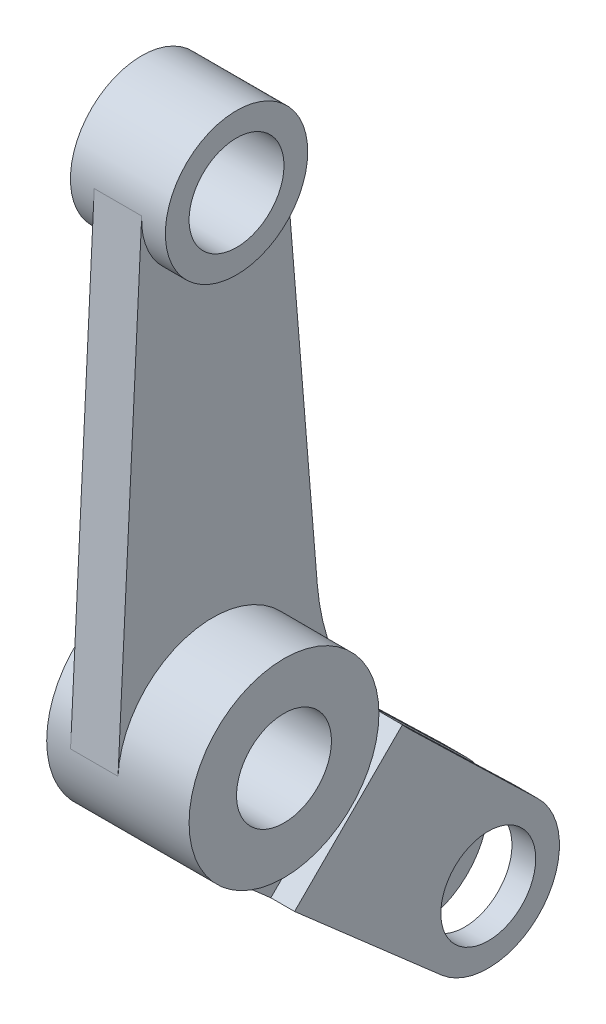
ISO-10303-21;
HEADER;
FILE_DESCRIPTION(('STEP AP214'),'2;1');
FILE_NAME('part.step','',(''),(''),'','','');
FILE_SCHEMA(('AUTOMOTIVE_DESIGN { 1 0 10303 214 1 1 1 1 }'));
ENDSEC;
DATA;
#1=APPLICATION_CONTEXT('core data for automotive mechanical design processes');
#2=APPLICATION_PROTOCOL_DEFINITION('international standard','automotive_design',2000,#1);
#3=PRODUCT_CONTEXT('',#1,'mechanical');
#4=PRODUCT('Part','Part','',(#3));
#5=PRODUCT_RELATED_PRODUCT_CATEGORY('part','',(#4));
#6=PRODUCT_DEFINITION_FORMATION('','',#4);
#7=PRODUCT_DEFINITION_CONTEXT('part definition',#1,'design');
#8=PRODUCT_DEFINITION('design','',#6,#7);
#9=PRODUCT_DEFINITION_SHAPE('','',#8);
#10=(LENGTH_UNIT() NAMED_UNIT(*) SI_UNIT(.MILLI.,.METRE.));
#11=(NAMED_UNIT(*) PLANE_ANGLE_UNIT() SI_UNIT($,.RADIAN.));
#12=(NAMED_UNIT(*) SI_UNIT($,.STERADIAN.) SOLID_ANGLE_UNIT());
#13=UNCERTAINTY_MEASURE_WITH_UNIT(LENGTH_MEASURE(1.E-05),#10,'distance_accuracy_value','');
#14=(GEOMETRIC_REPRESENTATION_CONTEXT(3) GLOBAL_UNCERTAINTY_ASSIGNED_CONTEXT((#13)) GLOBAL_UNIT_ASSIGNED_CONTEXT((#10,
#11,#12)) REPRESENTATION_CONTEXT('',''));
#15=CARTESIAN_POINT('',(0.,0.,0.));
#16=DIRECTION('',(0.,0.,1.));
#17=DIRECTION('',(1.,0.,0.));
#18=AXIS2_PLACEMENT_3D('',#15,#16,#17);
#19=CARTESIAN_POINT('',(10.,-53.0330085889911,-53.033008588991));
#20=DIRECTION('',(-1.,0.,0.));
#21=DIRECTION('',(0.,0.,1.));
#22=AXIS2_PLACEMENT_3D('',#19,#20,#21);
#23=CYLINDRICAL_SURFACE('',#22,15.);
#24=DIRECTION('',(-1.,0.,0.));
#25=VECTOR('',#24,1.);
#26=CARTESIAN_POINT('',(10.,-42.249316522445,-63.4595125770931));
#27=LINE('',#26,#25);
#28=CARTESIAN_POINT('',(0.,-42.249316522445,-63.4595125770931));
#29=VERTEX_POINT('',#28);
#30=CARTESIAN_POINT('',(-5.,-42.249316522445,-63.4595125770931));
#31=VERTEX_POINT('',#30);
#32=EDGE_CURVE('E270',#29,#31,#27,.T.);
#33=ORIENTED_EDGE('',*,*,#32,.F.);
#34=CARTESIAN_POINT('',(0.,-53.0330085889911,-53.033008588991));
#35=DIRECTION('',(-1.,0.,0.));
#36=DIRECTION('',(0.,0.,1.));
#37=AXIS2_PLACEMENT_3D('',#34,#35,#36);
#38=CIRCLE('',#37,15.);
#39=CARTESIAN_POINT('',(0.,-64.323120614436,-43.1571101259191));
#40=VERTEX_POINT('',#39);
#41=EDGE_CURVE('E49',#29,#40,#38,.T.);
#42=ORIENTED_EDGE('',*,*,#41,.T.);
#43=DIRECTION('',(-1.,0.,0.));
#44=VECTOR('',#43,1.);
#45=CARTESIAN_POINT('',(10.,-64.323120614436,-43.1571101259191));
#46=LINE('',#45,#44);
#47=CARTESIAN_POINT('',(-5.,-64.323120614436,-43.1571101259191));
#48=VERTEX_POINT('',#47);
#49=EDGE_CURVE('E175',#40,#48,#46,.T.);
#50=ORIENTED_EDGE('',*,*,#49,.T.);
#51=CARTESIAN_POINT('',(-5.,-53.0330085889911,-53.033008588991));
#52=DIRECTION('',(1.,0.,0.));
#53=DIRECTION('',(0.,0.,-1.));
#54=AXIS2_PLACEMENT_3D('',#51,#52,#53);
#55=CIRCLE('',#54,15.);
#56=EDGE_CURVE('E191',#48,#31,#55,.T.);
#57=ORIENTED_EDGE('',*,*,#56,.T.);
#58=EDGE_LOOP('',(#33,#42,#50,#57));
#59=FACE_BOUND('',#58,.T.);
#60=ADVANCED_FACE('F40',(#59),#23,.T.);
#61=CARTESIAN_POINT('',(10.,0.,0.));
#62=DIRECTION('',(1.,0.,0.));
#63=DIRECTION('',(0.,0.,-1.));
#64=AXIS2_PLACEMENT_3D('',#61,#62,#63);
#65=PLANE('',#64);
#66=DIRECTION('',(0.,-0.658393230871456,-0.75267413502966));
#67=VECTOR('',#66,1.);
#68=CARTESIAN_POINT('',(10.,-15.0534827005932,13.1678646174291));
#69=LINE('',#68,#67);
#70=CARTESIAN_POINT('',(10.,-15.0534827005932,13.1678646174291));
#71=VERTEX_POINT('',#70);
#72=CARTESIAN_POINT('',(10.,-37.2688105099598,-12.2286641730984));
#73=VERTEX_POINT('',#72);
#74=EDGE_CURVE('E267',#71,#73,#69,.T.);
#75=ORIENTED_EDGE('',*,*,#74,.T.);
#76=DIRECTION('',(0.,-0.707106781186546,0.707106781186549));
#77=VECTOR('',#76,1.);
#78=CARTESIAN_POINT('',(10.,-24.7487373415292,-24.7487373415291));
#79=LINE('',#78,#77);
#80=CARTESIAN_POINT('',(10.,-14.5505831027337,-34.9468915803247));
#81=VERTEX_POINT('',#80);
#82=EDGE_CURVE('E202',#81,#73,#79,.T.);
#83=ORIENTED_EDGE('',*,*,#82,.F.);
#84=CARTESIAN_POINT('',(10.,19.1992266841998,-71.8379520062031));
#85=DIRECTION('',(1.,0.,0.));
#86=DIRECTION('',(0.,0.,-1.));
#87=AXIS2_PLACEMENT_3D('',#84,#85,#86);
#88=CIRCLE('',#87,50.);
#89=CARTESIAN_POINT('',(10.,15.116319135825,-22.0049321704413));
#90=VERTEX_POINT('',#89);
#91=EDGE_CURVE('E258',#81,#90,#88,.F.);
#92=ORIENTED_EDGE('',*,*,#91,.T.);
#93=DIRECTION('',(0.,-0.996660396715235,-0.0816581509674995));
#94=VECTOR('',#93,1.);
#95=CARTESIAN_POINT('',(10.,1.89167762645559,-23.0884504645586));
#96=LINE('',#95,#94);
#97=CARTESIAN_POINT('',(10.,101.224872264512,-14.9499059507285));
#98=VERTEX_POINT('',#97);
#99=EDGE_CURVE('E260',#98,#90,#96,.T.);
#100=ORIENTED_EDGE('',*,*,#99,.F.);
#101=CARTESIAN_POINT('',(10.,100.,0.));
#102=DIRECTION('',(1.,0.,0.));
#103=DIRECTION('',(0.,0.,-1.));
#104=AXIS2_PLACEMENT_3D('',#101,#102,#103);
#105=CIRCLE('',#104,15.);
#106=CARTESIAN_POINT('',(10.,100.75,14.9812382665786));
#107=VERTEX_POINT('',#106);
#108=EDGE_CURVE('E251',#107,#98,#105,.T.);
#109=ORIENTED_EDGE('',*,*,#108,.F.);
#110=DIRECTION('',(0.,-0.998749217771909,0.05));
#111=VECTOR('',#110,1.);
#112=CARTESIAN_POINT('',(10.,0.999999999999999,19.9749843554382));
#113=LINE('',#112,#111);
#114=CARTESIAN_POINT('',(10.,0.999999999999999,19.9749843554382));
#115=VERTEX_POINT('',#114);
#116=EDGE_CURVE('E264',#107,#115,#113,.T.);
#117=ORIENTED_EDGE('',*,*,#116,.T.);
#118=CARTESIAN_POINT('',(10.,0.,0.));
#119=DIRECTION('',(1.,0.,0.));
#120=DIRECTION('',(0.,0.,-1.));
#121=AXIS2_PLACEMENT_3D('',#118,#119,#120);
#122=CIRCLE('',#121,20.);
#123=EDGE_CURVE('E250',#115,#71,#122,.F.);
#124=ORIENTED_EDGE('',*,*,#123,.T.);
#125=EDGE_LOOP('',(#75,#83,#92,#100,#109,#117,#124));
#126=FACE_BOUND('',#125,.T.);
#127=ADVANCED_FACE('F323',(#126),#65,.T.);
#128=CARTESIAN_POINT('',(10.,9.8758126273384,-9.54869622660444));
#129=DIRECTION('',(0.,0.718912804436409,-0.695100265873476));
#130=DIRECTION('',(0.,0.695100265873476,0.718912804436409));
#131=AXIS2_PLACEMENT_3D('',#128,#129,#130);
#132=PLANE('',#131);
#133=DIRECTION('',(0.,0.695100265873476,0.718912804436409));
#134=VECTOR('',#133,1.);
#135=CARTESIAN_POINT('',(0.,9.8758126273384,-9.54869622660444));
#136=LINE('',#135,#134);
#137=CARTESIAN_POINT('',(0.,-18.0929441372304,-38.4755983576934));
#138=VERTEX_POINT('',#137);
#139=EDGE_CURVE('E178',#29,#138,#136,.T.);
#140=ORIENTED_EDGE('',*,*,#139,.F.);
#141=ORIENTED_EDGE('',*,*,#32,.T.);
#142=DIRECTION('',(0.,0.695100265873476,0.718912804436409));
#143=VECTOR('',#142,1.);
#144=CARTESIAN_POINT('',(-5.,9.8758126273384,-9.54869622660444));
#145=LINE('',#144,#143);
#146=CARTESIAN_POINT('',(-5.,-16.7464135376208,-37.0829387125294));
#147=VERTEX_POINT('',#146);
#148=EDGE_CURVE('E188',#31,#147,#145,.T.);
#149=ORIENTED_EDGE('',*,*,#148,.T.);
#150=DIRECTION('',(-1.,0.,0.));
#151=VECTOR('',#150,1.);
#152=CARTESIAN_POINT('',(10.,-16.7464135376208,-37.0829387125294));
#153=LINE('',#152,#151);
#154=CARTESIAN_POINT('',(15.,-16.7464135376208,-37.0829387125294));
#155=VERTEX_POINT('',#154);
#156=EDGE_CURVE('E257',#155,#147,#153,.T.);
#157=ORIENTED_EDGE('',*,*,#156,.F.);
#158=DIRECTION('',(0.,0.695100265873476,0.718912804436409));
#159=VECTOR('',#158,1.);
#160=CARTESIAN_POINT('',(15.,9.8758126273384,-9.54869622660444));
#161=LINE('',#160,#159);
#162=CARTESIAN_POINT('',(15.,-42.249316522445,-63.4595125770931));
#163=VERTEX_POINT('',#162);
#164=EDGE_CURVE('E214',#163,#155,#161,.T.);
#165=ORIENTED_EDGE('',*,*,#164,.F.);
#166=CARTESIAN_POINT('',(10.,-42.249316522445,-63.4595125770931));
#167=VERTEX_POINT('',#166);
#168=EDGE_CURVE('E280',#163,#167,#27,.T.);
#169=ORIENTED_EDGE('',*,*,#168,.T.);
#170=DIRECTION('',(0.,-0.695100265873476,-0.718912804436409));
#171=VECTOR('',#170,1.);
#172=CARTESIAN_POINT('',(10.,9.8758126273384,-9.54869622660444));
#173=LINE('',#172,#171);
#174=CARTESIAN_POINT('',(10.,-18.0929441372304,-38.4755983576934));
#175=VERTEX_POINT('',#174);
#176=EDGE_CURVE('E56',#175,#167,#173,.T.);
#177=ORIENTED_EDGE('',*,*,#176,.F.);
#178=DIRECTION('',(-1.,0.,0.));
#179=VECTOR('',#178,1.);
#180=CARTESIAN_POINT('',(10.,-18.0929441372304,-38.4755983576934));
#181=LINE('',#180,#179);
#182=EDGE_CURVE('E167',#175,#138,#181,.T.);
#183=ORIENTED_EDGE('',*,*,#182,.T.);
#184=EDGE_LOOP('',(#140,#141,#149,#157,#165,#169,#177,#183));
#185=FACE_BOUND('',#184,.T.);
#186=ADVANCED_FACE('F42',(#185),#132,.T.);
#187=CARTESIAN_POINT('',(10.,19.1992266841998,-71.8379520062031));
#188=DIRECTION('',(-1.,0.,0.));
#189=DIRECTION('',(0.,0.,1.));
#190=AXIS2_PLACEMENT_3D('',#187,#188,#189);
#191=CYLINDRICAL_SURFACE('',#190,50.);
#192=ORIENTED_EDGE('',*,*,#156,.T.);
#193=CARTESIAN_POINT('',(-5.,19.1992266841998,-71.8379520062031));
#194=DIRECTION('',(1.,0.,0.));
#195=DIRECTION('',(0.,0.,-1.));
#196=AXIS2_PLACEMENT_3D('',#193,#194,#195);
#197=CIRCLE('',#196,50.);
#198=CARTESIAN_POINT('',(-5.,-14.5505831027337,-34.9468915803247));
#199=VERTEX_POINT('',#198);
#200=EDGE_CURVE('E185',#147,#199,#197,.F.);
#201=ORIENTED_EDGE('',*,*,#200,.T.);
#202=DIRECTION('',(1.,0.,0.));
#203=VECTOR('',#202,1.);
#204=CARTESIAN_POINT('',(-5.,-14.5505831027337,-34.9468915803247));
#205=LINE('',#204,#203);
#206=CARTESIAN_POINT('',(0.,-14.5505831027337,-34.9468915803247));
#207=VERTEX_POINT('',#206);
#208=EDGE_CURVE('E198',#199,#207,#205,.T.);
#209=ORIENTED_EDGE('',*,*,#208,.T.);
#210=CARTESIAN_POINT('',(0.,19.1992266841998,-71.8379520062031));
#211=DIRECTION('',(1.,0.,0.));
#212=DIRECTION('',(0.,0.,-1.));
#213=AXIS2_PLACEMENT_3D('',#210,#211,#212);
#214=CIRCLE('',#213,50.);
#215=CARTESIAN_POINT('',(0.,15.116319135825,-22.0049321704413));
#216=VERTEX_POINT('',#215);
#217=EDGE_CURVE('E254',#207,#216,#214,.F.);
#218=ORIENTED_EDGE('',*,*,#217,.T.);
#219=DIRECTION('',(-1.,0.,0.));
#220=VECTOR('',#219,1.);
#221=CARTESIAN_POINT('',(10.,15.116319135825,-22.0049321704413));
#222=LINE('',#221,#220);
#223=EDGE_CURVE('E297',#90,#216,#222,.T.);
#224=ORIENTED_EDGE('',*,*,#223,.F.);
#225=ORIENTED_EDGE('',*,*,#91,.F.);
#226=DIRECTION('',(-1.,0.,0.));
#227=VECTOR('',#226,1.);
#228=CARTESIAN_POINT('',(15.,-14.5505831027337,-34.9468915803247));
#229=LINE('',#228,#227);
#230=CARTESIAN_POINT('',(15.,-14.5505831027337,-34.9468915803247));
#231=VERTEX_POINT('',#230);
#232=EDGE_CURVE('E221',#231,#81,#229,.T.);
#233=ORIENTED_EDGE('',*,*,#232,.F.);
#234=CARTESIAN_POINT('',(15.,19.1992266841998,-71.8379520062031));
#235=DIRECTION('',(1.,0.,0.));
#236=DIRECTION('',(0.,0.,-1.));
#237=AXIS2_PLACEMENT_3D('',#234,#235,#236);
#238=CIRCLE('',#237,50.);
#239=EDGE_CURVE('E203',#155,#231,#238,.F.);
#240=ORIENTED_EDGE('',*,*,#239,.F.);
#241=EDGE_LOOP('',(#192,#201,#209,#218,#224,#225,#233,#240));
#242=FACE_BOUND('',#241,.T.);
#243=ADVANCED_FACE('F340',(#242),#191,.F.);
#244=CARTESIAN_POINT('',(10.,1.89167762645559,-23.0884504645586));
#245=DIRECTION('',(0.,0.0816581509674995,-0.996660396715235));
#246=DIRECTION('',(0.,0.996660396715235,0.0816581509674995));
#247=AXIS2_PLACEMENT_3D('',#244,#245,#246);
#248=PLANE('',#247);
#249=DIRECTION('',(0.,-0.996660396715235,-0.0816581509674995));
#250=VECTOR('',#249,1.);
#251=CARTESIAN_POINT('',(0.,1.89167762645559,-23.0884504645586));
#252=LINE('',#251,#250);
#253=CARTESIAN_POINT('',(0.,101.224872264512,-14.9499059507285));
#254=VERTEX_POINT('',#253);
#255=EDGE_CURVE('E272',#254,#216,#252,.T.);
#256=ORIENTED_EDGE('',*,*,#255,.F.);
#257=DIRECTION('',(-1.,0.,0.));
#258=VECTOR('',#257,1.);
#259=CARTESIAN_POINT('',(10.,101.224872264512,-14.9499059507285));
#260=LINE('',#259,#258);
#261=EDGE_CURVE('E294',#98,#254,#260,.T.);
#262=ORIENTED_EDGE('',*,*,#261,.F.);
#263=ORIENTED_EDGE('',*,*,#99,.T.);
#264=ORIENTED_EDGE('',*,*,#223,.T.);
#265=EDGE_LOOP('',(#256,#262,#263,#264));
#266=FACE_BOUND('',#265,.T.);
#267=ADVANCED_FACE('F380',(#266),#248,.T.);
#268=CARTESIAN_POINT('',(10.,100.,0.));
#269=DIRECTION('',(-1.,0.,0.));
#270=DIRECTION('',(0.,0.,1.));
#271=AXIS2_PLACEMENT_3D('',#268,#269,#270);
#272=CYLINDRICAL_SURFACE('',#271,15.);
#273=ORIENTED_EDGE('',*,*,#261,.T.);
#274=CARTESIAN_POINT('',(0.,100.,0.));
#275=DIRECTION('',(1.,0.,0.));
#276=DIRECTION('',(0.,0.,-1.));
#277=AXIS2_PLACEMENT_3D('',#274,#275,#276);
#278=CIRCLE('',#277,15.);
#279=CARTESIAN_POINT('',(0.,100.75,14.9812382665786));
#280=VERTEX_POINT('',#279);
#281=EDGE_CURVE('E248',#280,#254,#278,.T.);
#282=ORIENTED_EDGE('',*,*,#281,.F.);
#283=DIRECTION('',(-1.,0.,0.));
#284=VECTOR('',#283,1.);
#285=CARTESIAN_POINT('',(10.,100.75,14.9812382665786));
#286=LINE('',#285,#284);
#287=EDGE_CURVE('E291',#107,#280,#286,.T.);
#288=ORIENTED_EDGE('',*,*,#287,.F.);
#289=ORIENTED_EDGE('',*,*,#108,.T.);
#290=EDGE_LOOP('',(#273,#282,#288,#289));
#291=FACE_BOUND('',#290,.T.);
#292=CARTESIAN_POINT('',(15.,100.,0.));
#293=DIRECTION('',(1.,0.,0.));
#294=DIRECTION('',(0.,0.,-1.));
#295=AXIS2_PLACEMENT_3D('',#292,#293,#294);
#296=CIRCLE('',#295,15.);
#297=CARTESIAN_POINT('',(15.,100.,-15.));
#298=VERTEX_POINT('',#297);
#299=EDGE_CURVE('E247',#298,#298,#296,.T.);
#300=ORIENTED_EDGE('',*,*,#299,.F.);
#301=EDGE_LOOP('',(#300));
#302=FACE_BOUND('',#301,.T.);
#303=CARTESIAN_POINT('',(-5.,100.,0.));
#304=DIRECTION('',(1.,0.,0.));
#305=DIRECTION('',(0.,0.,-1.));
#306=AXIS2_PLACEMENT_3D('',#303,#304,#305);
#307=CIRCLE('',#306,15.);
#308=CARTESIAN_POINT('',(-5.,100.,-15.));
#309=VERTEX_POINT('',#308);
#310=EDGE_CURVE('E244',#309,#309,#307,.T.);
#311=ORIENTED_EDGE('',*,*,#310,.T.);
#312=EDGE_LOOP('',(#311));
#313=FACE_BOUND('',#312,.T.);
#314=ADVANCED_FACE('F376',(#291,#302,#313),#272,.T.);
#315=CARTESIAN_POINT('',(10.,0.999999999999999,19.9749843554382));
#316=DIRECTION('',(0.,-0.05,-0.998749217771909));
#317=DIRECTION('',(0.,0.998749217771909,-0.05));
#318=AXIS2_PLACEMENT_3D('',#315,#316,#317);
#319=PLANE('',#318);
#320=DIRECTION('',(0.,-0.998749217771909,0.05));
#321=VECTOR('',#320,1.);
#322=CARTESIAN_POINT('',(0.,0.999999999999999,19.9749843554382));
#323=LINE('',#322,#321);
#324=CARTESIAN_POINT('',(0.,0.999999999999999,19.9749843554382));
#325=VERTEX_POINT('',#324);
#326=EDGE_CURVE('E275',#280,#325,#323,.T.);
#327=ORIENTED_EDGE('',*,*,#326,.T.);
#328=DIRECTION('',(-1.,0.,0.));
#329=VECTOR('',#328,1.);
#330=CARTESIAN_POINT('',(10.,0.999999999999999,19.9749843554382));
#331=LINE('',#330,#329);
#332=EDGE_CURVE('E288',#115,#325,#331,.T.);
#333=ORIENTED_EDGE('',*,*,#332,.F.);
#334=ORIENTED_EDGE('',*,*,#116,.F.);
#335=ORIENTED_EDGE('',*,*,#287,.T.);
#336=EDGE_LOOP('',(#327,#333,#334,#335));
#337=FACE_BOUND('',#336,.T.);
#338=ADVANCED_FACE('F371',(#337),#319,.F.);
#339=CARTESIAN_POINT('',(10.,0.,0.));
#340=DIRECTION('',(-1.,0.,0.));
#341=DIRECTION('',(0.,0.,1.));
#342=AXIS2_PLACEMENT_3D('',#339,#340,#341);
#343=CYLINDRICAL_SURFACE('',#342,20.);
#344=ORIENTED_EDGE('',*,*,#332,.T.);
#345=CARTESIAN_POINT('',(0.,0.,0.));
#346=DIRECTION('',(-1.,0.,0.));
#347=DIRECTION('',(0.,0.,1.));
#348=AXIS2_PLACEMENT_3D('',#345,#346,#347);
#349=CIRCLE('',#348,20.);
#350=CARTESIAN_POINT('',(0.,-15.0534827005932,13.1678646174291));
#351=VERTEX_POINT('',#350);
#352=EDGE_CURVE('E235',#325,#351,#349,.T.);
#353=ORIENTED_EDGE('',*,*,#352,.T.);
#354=DIRECTION('',(-1.,0.,0.));
#355=VECTOR('',#354,1.);
#356=CARTESIAN_POINT('',(10.,-15.0534827005932,13.1678646174291));
#357=LINE('',#356,#355);
#358=EDGE_CURVE('E285',#71,#351,#357,.T.);
#359=ORIENTED_EDGE('',*,*,#358,.F.);
#360=ORIENTED_EDGE('',*,*,#123,.F.);
#361=EDGE_LOOP('',(#344,#353,#359,#360));
#362=FACE_BOUND('',#361,.T.);
#363=CARTESIAN_POINT('',(25.,0.,0.));
#364=DIRECTION('',(1.,0.,0.));
#365=DIRECTION('',(0.,0.,-1.));
#366=AXIS2_PLACEMENT_3D('',#363,#364,#365);
#367=CIRCLE('',#366,20.);
#368=CARTESIAN_POINT('',(25.,0.,-20.));
#369=VERTEX_POINT('',#368);
#370=EDGE_CURVE('E239',#369,#369,#367,.T.);
#371=ORIENTED_EDGE('',*,*,#370,.F.);
#372=EDGE_LOOP('',(#371));
#373=FACE_BOUND('',#372,.T.);
#374=CARTESIAN_POINT('',(-5.,0.,0.));
#375=DIRECTION('',(-1.,0.,0.));
#376=DIRECTION('',(0.,0.,1.));
#377=AXIS2_PLACEMENT_3D('',#374,#375,#376);
#378=CIRCLE('',#377,20.);
#379=CARTESIAN_POINT('',(-5.,0.,20.));
#380=VERTEX_POINT('',#379);
#381=EDGE_CURVE('E236',#380,#380,#378,.T.);
#382=ORIENTED_EDGE('',*,*,#381,.F.);
#383=EDGE_LOOP('',(#382));
#384=FACE_BOUND('',#383,.T.);
#385=ADVANCED_FACE('F329',(#362,#373,#384),#343,.T.);
#386=CARTESIAN_POINT('',(10.,-15.0534827005932,13.1678646174291));
#387=DIRECTION('',(0.,0.75267413502966,-0.658393230871456));
#388=DIRECTION('',(0.,0.658393230871456,0.75267413502966));
#389=AXIS2_PLACEMENT_3D('',#386,#387,#388);
#390=PLANE('',#389);
#391=ORIENTED_EDGE('',*,*,#49,.F.);
#392=DIRECTION('',(0.,0.658393230871456,0.75267413502966));
#393=VECTOR('',#392,1.);
#394=CARTESIAN_POINT('',(0.,-15.0534827005932,13.1678646174291));
#395=LINE('',#394,#393);
#396=CARTESIAN_POINT('',(0.,-40.5681166202618,-16.0004258746619));
#397=VERTEX_POINT('',#396);
#398=EDGE_CURVE('E173',#40,#397,#395,.T.);
#399=ORIENTED_EDGE('',*,*,#398,.T.);
#400=DIRECTION('',(-1.,0.,0.));
#401=VECTOR('',#400,1.);
#402=CARTESIAN_POINT('',(10.,-40.5681166202618,-16.000425874662));
#403=LINE('',#402,#401);
#404=CARTESIAN_POINT('',(10.,-40.5681166202618,-16.0004258746619));
#405=VERTEX_POINT('',#404);
#406=EDGE_CURVE('E11',#405,#397,#403,.T.);
#407=ORIENTED_EDGE('',*,*,#406,.F.);
#408=DIRECTION('',(0.,-0.658393230871456,-0.75267413502966));
#409=VECTOR('',#408,1.);
#410=CARTESIAN_POINT('',(10.,-15.0534827005932,13.1678646174291));
#411=LINE('',#410,#409);
#412=CARTESIAN_POINT('',(10.,-64.323120614436,-43.1571101259191));
#413=VERTEX_POINT('',#412);
#414=EDGE_CURVE('E153',#405,#413,#411,.T.);
#415=ORIENTED_EDGE('',*,*,#414,.T.);
#416=CARTESIAN_POINT('',(15.,-64.323120614436,-43.1571101259191));
#417=VERTEX_POINT('',#416);
#418=EDGE_CURVE('E283',#417,#413,#46,.T.);
#419=ORIENTED_EDGE('',*,*,#418,.F.);
#420=DIRECTION('',(0.,-0.658393230871456,-0.75267413502966));
#421=VECTOR('',#420,1.);
#422=CARTESIAN_POINT('',(15.,-15.0534827005932,13.1678646174291));
#423=LINE('',#422,#421);
#424=CARTESIAN_POINT('',(15.,-37.2688105099598,-12.2286641730984));
#425=VERTEX_POINT('',#424);
#426=EDGE_CURVE('E208',#425,#417,#423,.T.);
#427=ORIENTED_EDGE('',*,*,#426,.F.);
#428=DIRECTION('',(-1.,0.,0.));
#429=VECTOR('',#428,1.);
#430=CARTESIAN_POINT('',(15.,-37.2688105099598,-12.2286641730984));
#431=LINE('',#430,#429);
#432=EDGE_CURVE('E217',#425,#73,#431,.T.);
#433=ORIENTED_EDGE('',*,*,#432,.T.);
#434=ORIENTED_EDGE('',*,*,#74,.F.);
#435=ORIENTED_EDGE('',*,*,#358,.T.);
#436=DIRECTION('',(0.,-0.658393230871456,-0.75267413502966));
#437=VECTOR('',#436,1.);
#438=CARTESIAN_POINT('',(0.,-15.0534827005932,13.1678646174291));
#439=LINE('',#438,#437);
#440=CARTESIAN_POINT('',(0.,-37.2688105099598,-12.2286641730984));
#441=VERTEX_POINT('',#440);
#442=EDGE_CURVE('E261',#351,#441,#439,.T.);
#443=ORIENTED_EDGE('',*,*,#442,.T.);
#444=DIRECTION('',(1.,0.,0.));
#445=VECTOR('',#444,1.);
#446=CARTESIAN_POINT('',(-5.,-37.2688105099598,-12.2286641730984));
#447=LINE('',#446,#445);
#448=CARTESIAN_POINT('',(-5.,-37.2688105099598,-12.2286641730984));
#449=VERTEX_POINT('',#448);
#450=EDGE_CURVE('E64',#449,#441,#447,.T.);
#451=ORIENTED_EDGE('',*,*,#450,.F.);
#452=DIRECTION('',(0.,-0.658393230871456,-0.75267413502966));
#453=VECTOR('',#452,1.);
#454=CARTESIAN_POINT('',(-5.,-15.0534827005932,13.1678646174291));
#455=LINE('',#454,#453);
#456=EDGE_CURVE('E194',#449,#48,#455,.T.);
#457=ORIENTED_EDGE('',*,*,#456,.T.);
#458=EDGE_LOOP('',(#391,#399,#407,#415,#419,#427,#433,#434,#435,#443,#451,#457));
#459=FACE_BOUND('',#458,.T.);
#460=ADVANCED_FACE('F172',(#459),#390,.F.);
#461=ORIENTED_EDGE('',*,*,#418,.T.);
#462=CARTESIAN_POINT('',(10.,-53.0330085889911,-53.033008588991));
#463=DIRECTION('',(1.,0.,0.));
#464=DIRECTION('',(0.,0.,-1.));
#465=AXIS2_PLACEMENT_3D('',#462,#463,#464);
#466=CIRCLE('',#465,15.);
#467=EDGE_CURVE('E157',#413,#167,#466,.T.);
#468=ORIENTED_EDGE('',*,*,#467,.T.);
#469=ORIENTED_EDGE('',*,*,#168,.F.);
#470=CARTESIAN_POINT('',(15.,-53.0330085889911,-53.033008588991));
#471=DIRECTION('',(1.,0.,0.));
#472=DIRECTION('',(0.,0.,-1.));
#473=AXIS2_PLACEMENT_3D('',#470,#471,#472);
#474=CIRCLE('',#473,15.);
#475=EDGE_CURVE('E211',#417,#163,#474,.T.);
#476=ORIENTED_EDGE('',*,*,#475,.F.);
#477=EDGE_LOOP('',(#461,#468,#469,#476));
#478=FACE_BOUND('',#477,.T.);
#479=ADVANCED_FACE('F313',(#478),#23,.T.);
#480=CARTESIAN_POINT('',(0.,0.,0.));
#481=DIRECTION('',(1.,0.,0.));
#482=DIRECTION('',(0.,0.,-1.));
#483=AXIS2_PLACEMENT_3D('',#480,#481,#482);
#484=PLANE('',#483);
#485=ORIENTED_EDGE('',*,*,#217,.F.);
#486=DIRECTION('',(0.,-0.707106781186546,0.707106781186549));
#487=VECTOR('',#486,1.);
#488=CARTESIAN_POINT('',(0.,-24.7487373415292,-24.7487373415291));
#489=LINE('',#488,#487);
#490=EDGE_CURVE('E184',#207,#441,#489,.T.);
#491=ORIENTED_EDGE('',*,*,#490,.T.);
#492=ORIENTED_EDGE('',*,*,#442,.F.);
#493=ORIENTED_EDGE('',*,*,#352,.F.);
#494=ORIENTED_EDGE('',*,*,#326,.F.);
#495=ORIENTED_EDGE('',*,*,#281,.T.);
#496=ORIENTED_EDGE('',*,*,#255,.T.);
#497=EDGE_LOOP('',(#485,#491,#492,#493,#494,#495,#496));
#498=FACE_BOUND('',#497,.T.);
#499=ADVANCED_FACE('F334',(#498),#484,.F.);
#500=CARTESIAN_POINT('',(15.,100.,0.));
#501=DIRECTION('',(1.,0.,0.));
#502=DIRECTION('',(0.,0.,-1.));
#503=AXIS2_PLACEMENT_3D('',#500,#501,#502);
#504=PLANE('',#503);
#505=CARTESIAN_POINT('',(15.,100.,0.));
#506=DIRECTION('',(1.,0.,0.));
#507=DIRECTION('',(0.,0.,-1.));
#508=AXIS2_PLACEMENT_3D('',#505,#506,#507);
#509=CIRCLE('',#508,10.);
#510=CARTESIAN_POINT('',(15.,100.,-10.));
#511=VERTEX_POINT('',#510);
#512=EDGE_CURVE('E227',#511,#511,#509,.T.);
#513=ORIENTED_EDGE('',*,*,#512,.F.);
#514=EDGE_LOOP('',(#513));
#515=FACE_BOUND('',#514,.T.);
#516=ORIENTED_EDGE('',*,*,#299,.T.);
#517=EDGE_LOOP('',(#516));
#518=FACE_BOUND('',#517,.T.);
#519=ADVANCED_FACE('F367',(#515,#518),#504,.T.);
#520=CARTESIAN_POINT('',(-5.,100.,0.));
#521=DIRECTION('',(-1.,0.,0.));
#522=DIRECTION('',(0.,0.,-1.));
#523=AXIS2_PLACEMENT_3D('',#520,#521,#522);
#524=PLANE('',#523);
#525=CARTESIAN_POINT('',(-5.,100.,0.));
#526=DIRECTION('',(1.,0.,0.));
#527=DIRECTION('',(0.,0.,-1.));
#528=AXIS2_PLACEMENT_3D('',#525,#526,#527);
#529=CIRCLE('',#528,10.);
#530=CARTESIAN_POINT('',(-5.,100.,-10.));
#531=VERTEX_POINT('',#530);
#532=EDGE_CURVE('E224',#531,#531,#529,.T.);
#533=ORIENTED_EDGE('',*,*,#532,.T.);
#534=EDGE_LOOP('',(#533));
#535=FACE_BOUND('',#534,.T.);
#536=ORIENTED_EDGE('',*,*,#310,.F.);
#537=EDGE_LOOP('',(#536));
#538=FACE_BOUND('',#537,.T.);
#539=ADVANCED_FACE('F524',(#535,#538),#524,.T.);
#540=CARTESIAN_POINT('',(25.,0.,0.));
#541=DIRECTION('',(1.,0.,0.));
#542=DIRECTION('',(0.,0.,-1.));
#543=AXIS2_PLACEMENT_3D('',#540,#541,#542);
#544=PLANE('',#543);
#545=CARTESIAN_POINT('',(25.,0.,0.));
#546=DIRECTION('',(1.,0.,0.));
#547=DIRECTION('',(0.,0.,-1.));
#548=AXIS2_PLACEMENT_3D('',#545,#546,#547);
#549=CIRCLE('',#548,10.);
#550=CARTESIAN_POINT('',(25.,0.,-10.));
#551=VERTEX_POINT('',#550);
#552=EDGE_CURVE('E223',#551,#551,#549,.T.);
#553=ORIENTED_EDGE('',*,*,#552,.F.);
#554=EDGE_LOOP('',(#553));
#555=FACE_BOUND('',#554,.T.);
#556=ORIENTED_EDGE('',*,*,#370,.T.);
#557=EDGE_LOOP('',(#556));
#558=FACE_BOUND('',#557,.T.);
#559=ADVANCED_FACE('F520',(#555,#558),#544,.T.);
#560=CARTESIAN_POINT('',(-5.,0.,0.));
#561=DIRECTION('',(-1.,0.,0.));
#562=DIRECTION('',(0.,0.,1.));
#563=AXIS2_PLACEMENT_3D('',#560,#561,#562);
#564=PLANE('',#563);
#565=CARTESIAN_POINT('',(-5.,0.,0.));
#566=DIRECTION('',(1.,0.,0.));
#567=DIRECTION('',(0.,0.,-1.));
#568=AXIS2_PLACEMENT_3D('',#565,#566,#567);
#569=CIRCLE('',#568,10.);
#570=CARTESIAN_POINT('',(-5.,0.,-10.));
#571=VERTEX_POINT('',#570);
#572=EDGE_CURVE('E228',#571,#571,#569,.T.);
#573=ORIENTED_EDGE('',*,*,#572,.T.);
#574=EDGE_LOOP('',(#573));
#575=FACE_BOUND('',#574,.T.);
#576=ORIENTED_EDGE('',*,*,#381,.T.);
#577=EDGE_LOOP('',(#576));
#578=FACE_BOUND('',#577,.T.);
#579=ADVANCED_FACE('F516',(#575,#578),#564,.T.);
#580=CARTESIAN_POINT('',(-5.,0.,0.));
#581=DIRECTION('',(1.,0.,0.));
#582=DIRECTION('',(0.,0.,-1.));
#583=AXIS2_PLACEMENT_3D('',#580,#581,#582);
#584=CYLINDRICAL_SURFACE('',#583,10.);
#585=ORIENTED_EDGE('',*,*,#572,.F.);
#586=EDGE_LOOP('',(#585));
#587=FACE_BOUND('',#586,.T.);
#588=ORIENTED_EDGE('',*,*,#552,.T.);
#589=EDGE_LOOP('',(#588));
#590=FACE_BOUND('',#589,.T.);
#591=ADVANCED_FACE('F512',(#587,#590),#584,.F.);
#592=CARTESIAN_POINT('',(-5.,100.,0.));
#593=DIRECTION('',(1.,0.,0.));
#594=DIRECTION('',(0.,0.,-1.));
#595=AXIS2_PLACEMENT_3D('',#592,#593,#594);
#596=CYLINDRICAL_SURFACE('',#595,10.);
#597=ORIENTED_EDGE('',*,*,#512,.T.);
#598=EDGE_LOOP('',(#597));
#599=FACE_BOUND('',#598,.T.);
#600=ORIENTED_EDGE('',*,*,#532,.F.);
#601=EDGE_LOOP('',(#600));
#602=FACE_BOUND('',#601,.T.);
#603=ADVANCED_FACE('F402',(#599,#602),#596,.F.);
#604=CARTESIAN_POINT('',(15.,-24.7487373415292,-24.7487373415291));
#605=DIRECTION('',(0.,-0.707106781186549,-0.707106781186546));
#606=DIRECTION('',(0.,0.707106781186546,-0.707106781186549));
#607=AXIS2_PLACEMENT_3D('',#604,#605,#606);
#608=PLANE('',#607);
#609=ORIENTED_EDGE('',*,*,#82,.T.);
#610=ORIENTED_EDGE('',*,*,#432,.F.);
#611=DIRECTION('',(0.,-0.707106781186546,0.707106781186549));
#612=VECTOR('',#611,1.);
#613=CARTESIAN_POINT('',(15.,-24.7487373415292,-24.7487373415291));
#614=LINE('',#613,#612);
#615=EDGE_CURVE('E206',#231,#425,#614,.T.);
#616=ORIENTED_EDGE('',*,*,#615,.F.);
#617=ORIENTED_EDGE('',*,*,#232,.T.);
#618=EDGE_LOOP('',(#609,#610,#616,#617));
#619=FACE_BOUND('',#618,.T.);
#620=ADVANCED_FACE('F407',(#619),#608,.F.);
#621=CARTESIAN_POINT('',(15.,0.,0.));
#622=DIRECTION('',(1.,0.,0.));
#623=DIRECTION('',(0.,0.,-1.));
#624=AXIS2_PLACEMENT_3D('',#621,#622,#623);
#625=PLANE('',#624);
#626=CARTESIAN_POINT('',(15.,-53.0330085889911,-53.033008588991));
#627=DIRECTION('',(1.,0.,0.));
#628=DIRECTION('',(0.,0.,-1.));
#629=AXIS2_PLACEMENT_3D('',#626,#627,#628);
#630=CIRCLE('',#629,9.99999999999999);
#631=CARTESIAN_POINT('',(15.,-53.0330085889911,-63.033008588991));
#632=VERTEX_POINT('',#631);
#633=EDGE_CURVE('E502',#632,#632,#630,.T.);
#634=ORIENTED_EDGE('',*,*,#633,.F.);
#635=EDGE_LOOP('',(#634));
#636=FACE_BOUND('',#635,.T.);
#637=ORIENTED_EDGE('',*,*,#239,.T.);
#638=ORIENTED_EDGE('',*,*,#615,.T.);
#639=ORIENTED_EDGE('',*,*,#426,.T.);
#640=ORIENTED_EDGE('',*,*,#475,.T.);
#641=ORIENTED_EDGE('',*,*,#164,.T.);
#642=EDGE_LOOP('',(#637,#638,#639,#640,#641));
#643=FACE_BOUND('',#642,.T.);
#644=ADVANCED_FACE('F315',(#636,#643),#625,.T.);
#645=CARTESIAN_POINT('',(-5.,-24.7487373415292,-24.7487373415291));
#646=DIRECTION('',(0.,0.707106781186549,0.707106781186546));
#647=DIRECTION('',(0.,-0.707106781186546,0.707106781186549));
#648=AXIS2_PLACEMENT_3D('',#645,#646,#647);
#649=PLANE('',#648);
#650=ORIENTED_EDGE('',*,*,#490,.F.);
#651=ORIENTED_EDGE('',*,*,#208,.F.);
#652=DIRECTION('',(0.,-0.707106781186546,0.707106781186549));
#653=VECTOR('',#652,1.);
#654=CARTESIAN_POINT('',(-5.,-24.7487373415292,-24.7487373415291));
#655=LINE('',#654,#653);
#656=EDGE_CURVE('E196',#199,#449,#655,.T.);
#657=ORIENTED_EDGE('',*,*,#656,.T.);
#658=ORIENTED_EDGE('',*,*,#450,.T.);
#659=EDGE_LOOP('',(#650,#651,#657,#658));
#660=FACE_BOUND('',#659,.T.);
#661=ADVANCED_FACE('F336',(#660),#649,.T.);
#662=CARTESIAN_POINT('',(-5.,0.,0.));
#663=DIRECTION('',(-1.,0.,0.));
#664=DIRECTION('',(0.,0.,-1.));
#665=AXIS2_PLACEMENT_3D('',#662,#663,#664);
#666=PLANE('',#665);
#667=CARTESIAN_POINT('',(-5.,-53.0330085889911,-53.033008588991));
#668=DIRECTION('',(1.,0.,0.));
#669=DIRECTION('',(0.,0.,-1.));
#670=AXIS2_PLACEMENT_3D('',#667,#668,#669);
#671=CIRCLE('',#670,9.99999999999999);
#672=CARTESIAN_POINT('',(-5.,-53.0330085889911,-63.033008588991));
#673=VERTEX_POINT('',#672);
#674=EDGE_CURVE('E494',#673,#673,#671,.T.);
#675=ORIENTED_EDGE('',*,*,#674,.T.);
#676=EDGE_LOOP('',(#675));
#677=FACE_BOUND('',#676,.T.);
#678=ORIENTED_EDGE('',*,*,#200,.F.);
#679=ORIENTED_EDGE('',*,*,#148,.F.);
#680=ORIENTED_EDGE('',*,*,#56,.F.);
#681=ORIENTED_EDGE('',*,*,#456,.F.);
#682=ORIENTED_EDGE('',*,*,#656,.F.);
#683=EDGE_LOOP('',(#678,#679,#680,#681,#682));
#684=FACE_BOUND('',#683,.T.);
#685=ADVANCED_FACE('F342',(#677,#684),#666,.T.);
#686=CARTESIAN_POINT('',(0.,-28.2842712474619,-28.2842712474619));
#687=DIRECTION('',(0.,-0.707106781186548,-0.707106781186547));
#688=DIRECTION('',(0.,0.707106781186547,-0.707106781186548));
#689=AXIS2_PLACEMENT_3D('',#686,#687,#688);
#690=PLANE('',#689);
#691=DIRECTION('',(0.,0.707106781186547,-0.707106781186548));
#692=VECTOR('',#691,1.);
#693=CARTESIAN_POINT('',(10.,-51.9677255597723,-4.60081693515146));
#694=LINE('',#693,#692);
#695=EDGE_CURVE('E156',#405,#175,#694,.T.);
#696=ORIENTED_EDGE('',*,*,#695,.F.);
#697=ORIENTED_EDGE('',*,*,#406,.T.);
#698=DIRECTION('',(0.,-0.707106781186547,0.707106781186548));
#699=VECTOR('',#698,1.);
#700=CARTESIAN_POINT('',(0.,-51.9677255597723,-4.60081693515146));
#701=LINE('',#700,#699);
#702=EDGE_CURVE('E168',#138,#397,#701,.T.);
#703=ORIENTED_EDGE('',*,*,#702,.F.);
#704=ORIENTED_EDGE('',*,*,#182,.F.);
#705=EDGE_LOOP('',(#696,#697,#703,#704));
#706=FACE_BOUND('',#705,.T.);
#707=ADVANCED_FACE('F163',(#706),#690,.T.);
#708=CARTESIAN_POINT('',(0.,-115.607335866562,-68.2404272419407));
#709=DIRECTION('',(-1.,0.,0.));
#710=DIRECTION('',(0.,0.,1.));
#711=AXIS2_PLACEMENT_3D('',#708,#709,#710);
#712=PLANE('',#711);
#713=CARTESIAN_POINT('',(0.,-53.0330085889911,-53.033008588991));
#714=DIRECTION('',(-1.,0.,0.));
#715=DIRECTION('',(0.,0.,1.));
#716=AXIS2_PLACEMENT_3D('',#713,#714,#715);
#717=CIRCLE('',#716,9.99999999999999);
#718=CARTESIAN_POINT('',(0.,-53.0330085889911,-43.033008588991));
#719=VERTEX_POINT('',#718);
#720=EDGE_CURVE('E497',#719,#719,#717,.T.);
#721=ORIENTED_EDGE('',*,*,#720,.T.);
#722=EDGE_LOOP('',(#721));
#723=FACE_BOUND('',#722,.T.);
#724=ORIENTED_EDGE('',*,*,#139,.T.);
#725=ORIENTED_EDGE('',*,*,#702,.T.);
#726=ORIENTED_EDGE('',*,*,#398,.F.);
#727=ORIENTED_EDGE('',*,*,#41,.F.);
#728=EDGE_LOOP('',(#724,#725,#726,#727));
#729=FACE_BOUND('',#728,.T.);
#730=ADVANCED_FACE('F307',(#723,#729),#712,.F.);
#731=CARTESIAN_POINT('',(10.,-115.607335866562,-68.2404272419407));
#732=DIRECTION('',(1.,0.,0.));
#733=DIRECTION('',(0.,0.,-1.));
#734=AXIS2_PLACEMENT_3D('',#731,#732,#733);
#735=PLANE('',#734);
#736=CARTESIAN_POINT('',(10.,-53.0330085889911,-53.033008588991));
#737=DIRECTION('',(1.,0.,0.));
#738=DIRECTION('',(0.,0.,-1.));
#739=AXIS2_PLACEMENT_3D('',#736,#737,#738);
#740=CIRCLE('',#739,9.99999999999999);
#741=CARTESIAN_POINT('',(10.,-53.0330085889911,-63.033008588991));
#742=VERTEX_POINT('',#741);
#743=EDGE_CURVE('E44',#742,#742,#740,.T.);
#744=ORIENTED_EDGE('',*,*,#743,.T.);
#745=EDGE_LOOP('',(#744));
#746=FACE_BOUND('',#745,.T.);
#747=ORIENTED_EDGE('',*,*,#176,.T.);
#748=ORIENTED_EDGE('',*,*,#467,.F.);
#749=ORIENTED_EDGE('',*,*,#414,.F.);
#750=ORIENTED_EDGE('',*,*,#695,.T.);
#751=EDGE_LOOP('',(#747,#748,#749,#750));
#752=FACE_BOUND('',#751,.T.);
#753=ADVANCED_FACE('F155',(#746,#752),#735,.F.);
#754=CARTESIAN_POINT('',(-5.,-53.0330085889911,-53.033008588991));
#755=DIRECTION('',(1.,0.,0.));
#756=DIRECTION('',(0.,0.,-1.));
#757=AXIS2_PLACEMENT_3D('',#754,#755,#756);
#758=CYLINDRICAL_SURFACE('',#757,9.99999999999999);
#759=ORIENTED_EDGE('',*,*,#633,.T.);
#760=EDGE_LOOP('',(#759));
#761=FACE_BOUND('',#760,.T.);
#762=ORIENTED_EDGE('',*,*,#743,.F.);
#763=EDGE_LOOP('',(#762));
#764=FACE_BOUND('',#763,.T.);
#765=ADVANCED_FACE('F468',(#761,#764),#758,.F.);
#766=ORIENTED_EDGE('',*,*,#674,.F.);
#767=EDGE_LOOP('',(#766));
#768=FACE_BOUND('',#767,.T.);
#769=ORIENTED_EDGE('',*,*,#720,.F.);
#770=EDGE_LOOP('',(#769));
#771=FACE_BOUND('',#770,.T.);
#772=ADVANCED_FACE('F477',(#768,#771),#758,.F.);
#773=CLOSED_SHELL('',(#60,#127,#186,#243,#267,#314,#338,#385,#460,#479,#499,#519,#539,#559,#579,
#591,#603,#620,#644,#661,#685,#707,#730,#753,#765,#772));
#774=MANIFOLD_SOLID_BREP('B2',#773);
#775=ADVANCED_BREP_SHAPE_REPRESENTATION('',(#18,#774),#14);
#776=SHAPE_DEFINITION_REPRESENTATION(#9,#775);
ENDSEC;
END-ISO-10303-21;
